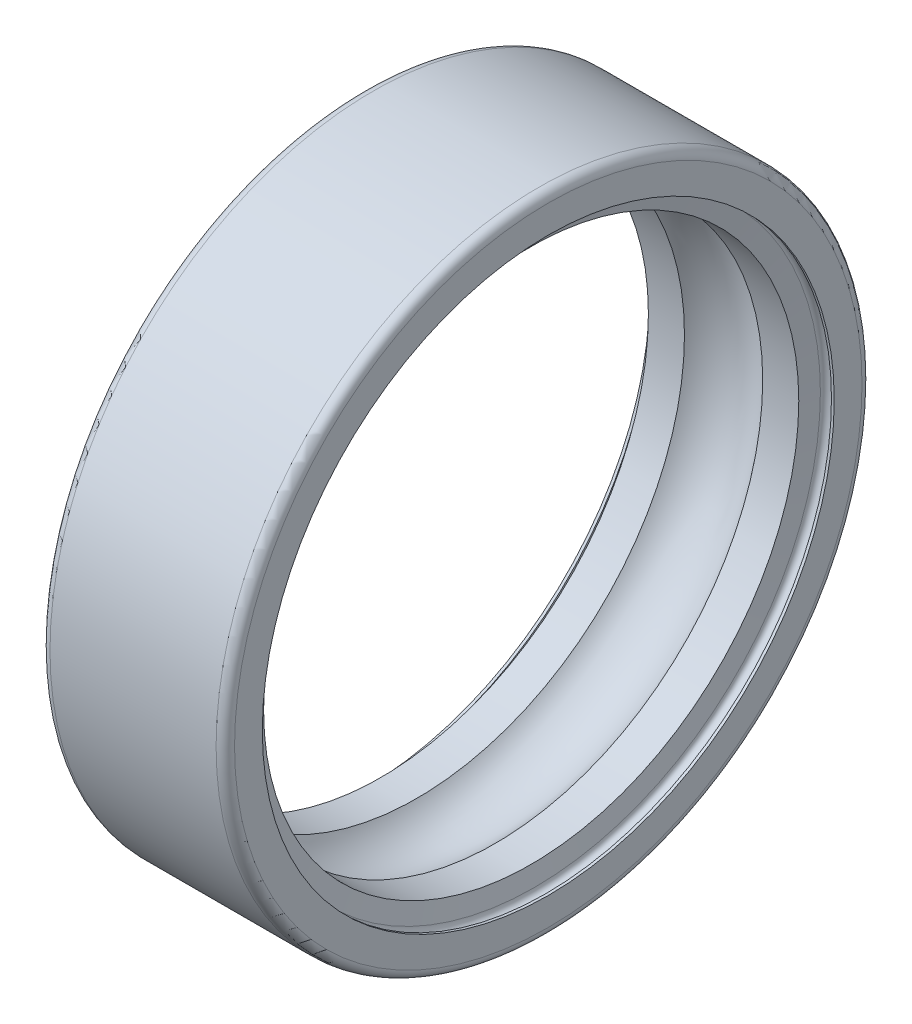
ISO-10303-21;
HEADER;
FILE_DESCRIPTION(('STEP AP214'),'2;1');
FILE_NAME('part.step','',(''),(''),'','','');
FILE_SCHEMA(('AUTOMOTIVE_DESIGN { 1 0 10303 214 1 1 1 1 }'));
ENDSEC;
DATA;
#1=APPLICATION_CONTEXT('core data for automotive mechanical design processes');
#2=APPLICATION_PROTOCOL_DEFINITION('international standard','automotive_design',2000,#1);
#3=PRODUCT_CONTEXT('',#1,'mechanical');
#4=PRODUCT('Part','Part','',(#3));
#5=PRODUCT_RELATED_PRODUCT_CATEGORY('part','',(#4));
#6=PRODUCT_DEFINITION_FORMATION('','',#4);
#7=PRODUCT_DEFINITION_CONTEXT('part definition',#1,'design');
#8=PRODUCT_DEFINITION('design','',#6,#7);
#9=PRODUCT_DEFINITION_SHAPE('','',#8);
#10=(LENGTH_UNIT() NAMED_UNIT(*) SI_UNIT(.MILLI.,.METRE.));
#11=(NAMED_UNIT(*) PLANE_ANGLE_UNIT() SI_UNIT($,.RADIAN.));
#12=(NAMED_UNIT(*) SI_UNIT($,.STERADIAN.) SOLID_ANGLE_UNIT());
#13=UNCERTAINTY_MEASURE_WITH_UNIT(LENGTH_MEASURE(1.E-05),#10,'distance_accuracy_value','');
#14=(GEOMETRIC_REPRESENTATION_CONTEXT(3) GLOBAL_UNCERTAINTY_ASSIGNED_CONTEXT((#13)) GLOBAL_UNIT_ASSIGNED_CONTEXT((#10,
#11,#12)) REPRESENTATION_CONTEXT('',''));
#15=CARTESIAN_POINT('',(0.,0.,0.));
#16=DIRECTION('',(0.,0.,1.));
#17=DIRECTION('',(1.,0.,0.));
#18=AXIS2_PLACEMENT_3D('',#15,#16,#17);
#19=CARTESIAN_POINT('',(50.,0.,0.));
#20=DIRECTION('',(1.,0.,0.));
#21=DIRECTION('',(0.,0.,-1.));
#22=AXIS2_PLACEMENT_3D('',#19,#20,#21);
#23=CYLINDRICAL_SURFACE('',#22,21.);
#24=CARTESIAN_POINT('',(11.4,0.,0.));
#25=DIRECTION('',(1.,0.,0.));
#26=DIRECTION('',(0.,0.,-1.));
#27=AXIS2_PLACEMENT_3D('',#24,#25,#26);
#28=CIRCLE('',#27,21.);
#29=CARTESIAN_POINT('',(11.4,0.,-21.));
#30=VERTEX_POINT('',#29);
#31=EDGE_CURVE('E11',#30,#30,#28,.T.);
#32=ORIENTED_EDGE('',*,*,#31,.F.);
#33=EDGE_LOOP('',(#32));
#34=FACE_BOUND('',#33,.T.);
#35=CARTESIAN_POINT('',(0.6,0.,0.));
#36=DIRECTION('',(1.,0.,0.));
#37=DIRECTION('',(0.,0.,-1.));
#38=AXIS2_PLACEMENT_3D('',#35,#36,#37);
#39=CIRCLE('',#38,21.);
#40=CARTESIAN_POINT('',(0.6,0.,-21.));
#41=VERTEX_POINT('',#40);
#42=EDGE_CURVE('E128',#41,#41,#39,.T.);
#43=ORIENTED_EDGE('',*,*,#42,.T.);
#44=EDGE_LOOP('',(#43));
#45=FACE_BOUND('',#44,.T.);
#46=ADVANCED_FACE('F17',(#34,#45),#23,.T.);
#47=CARTESIAN_POINT('',(11.4,0.,0.));
#48=DIRECTION('',(1.,0.,0.));
#49=DIRECTION('',(0.,0.,-1.));
#50=AXIS2_PLACEMENT_3D('',#47,#48,#49);
#51=TOROIDAL_SURFACE('',#50,20.4,0.600000000000007);
#52=CARTESIAN_POINT('',(12.,0.,0.));
#53=DIRECTION('',(1.,0.,0.));
#54=DIRECTION('',(0.,0.,-1.));
#55=AXIS2_PLACEMENT_3D('',#52,#53,#54);
#56=CIRCLE('',#55,20.4);
#57=CARTESIAN_POINT('',(12.,0.,-20.4));
#58=VERTEX_POINT('',#57);
#59=EDGE_CURVE('E28',#58,#58,#56,.T.);
#60=ORIENTED_EDGE('',*,*,#59,.F.);
#61=EDGE_LOOP('',(#60));
#62=FACE_BOUND('',#61,.T.);
#63=ORIENTED_EDGE('',*,*,#31,.T.);
#64=EDGE_LOOP('',(#63));
#65=FACE_BOUND('',#64,.T.);
#66=ADVANCED_FACE('F159',(#62,#65),#51,.T.);
#67=CARTESIAN_POINT('',(12.,18.595,0.));
#68=DIRECTION('',(1.,0.,0.));
#69=DIRECTION('',(0.,1.,0.));
#70=AXIS2_PLACEMENT_3D('',#67,#68,#69);
#71=PLANE('',#70);
#72=CARTESIAN_POINT('',(12.,0.,0.));
#73=DIRECTION('',(1.,0.,0.));
#74=DIRECTION('',(0.,0.,-1.));
#75=AXIS2_PLACEMENT_3D('',#72,#73,#74);
#76=CIRCLE('',#75,18.595);
#77=CARTESIAN_POINT('',(12.,0.,-18.595));
#78=VERTEX_POINT('',#77);
#79=EDGE_CURVE('E115',#78,#78,#76,.T.);
#80=ORIENTED_EDGE('',*,*,#79,.F.);
#81=EDGE_LOOP('',(#80));
#82=FACE_BOUND('',#81,.T.);
#83=ORIENTED_EDGE('',*,*,#59,.T.);
#84=EDGE_LOOP('',(#83));
#85=FACE_BOUND('',#84,.T.);
#86=ADVANCED_FACE('F19',(#82,#85),#71,.T.);
#87=CARTESIAN_POINT('',(50.,0.,0.));
#88=DIRECTION('',(1.,0.,0.));
#89=DIRECTION('',(0.,0.,-1.));
#90=AXIS2_PLACEMENT_3D('',#87,#88,#89);
#91=CYLINDRICAL_SURFACE('',#90,18.595);
#92=CARTESIAN_POINT('',(11.82,0.,0.));
#93=DIRECTION('',(1.,0.,0.));
#94=DIRECTION('',(0.,0.,-1.));
#95=AXIS2_PLACEMENT_3D('',#92,#93,#94);
#96=CIRCLE('',#95,18.595);
#97=CARTESIAN_POINT('',(11.82,0.,-18.595));
#98=VERTEX_POINT('',#97);
#99=EDGE_CURVE('E110',#98,#98,#96,.T.);
#100=ORIENTED_EDGE('',*,*,#99,.F.);
#101=EDGE_LOOP('',(#100));
#102=FACE_BOUND('',#101,.T.);
#103=ORIENTED_EDGE('',*,*,#79,.T.);
#104=EDGE_LOOP('',(#103));
#105=FACE_BOUND('',#104,.T.);
#106=ADVANCED_FACE('F175',(#102,#105),#91,.F.);
#107=CARTESIAN_POINT('',(11.46,0.,0.));
#108=DIRECTION('',(1.,0.,0.));
#109=DIRECTION('',(0.,0.,-1.));
#110=AXIS2_PLACEMENT_3D('',#107,#108,#109);
#111=TOROIDAL_SURFACE('',#110,18.5950000189953,0.36);
#112=ORIENTED_EDGE('',*,*,#99,.T.);
#113=EDGE_LOOP('',(#112));
#114=FACE_BOUND('',#113,.T.);
#115=CARTESIAN_POINT('',(11.1,0.,0.));
#116=DIRECTION('',(1.,0.,0.));
#117=DIRECTION('',(0.,0.,-1.));
#118=AXIS2_PLACEMENT_3D('',#115,#116,#117);
#119=CIRCLE('',#118,18.595);
#120=CARTESIAN_POINT('',(11.1,0.,-18.595));
#121=VERTEX_POINT('',#120);
#122=EDGE_CURVE('E109',#121,#121,#119,.T.);
#123=ORIENTED_EDGE('',*,*,#122,.F.);
#124=EDGE_LOOP('',(#123));
#125=FACE_BOUND('',#124,.T.);
#126=ADVANCED_FACE('F171',(#114,#125),#111,.F.);
#127=CARTESIAN_POINT('',(10.8892892580534,0.,0.));
#128=DIRECTION('',(1.,0.,0.));
#129=DIRECTION('',(0.,0.,-1.));
#130=AXIS2_PLACEMENT_3D('',#127,#128,#129);
#131=CONICAL_SURFACE('',#130,17.4,1.39626340159546);
#132=CARTESIAN_POINT('',(10.8892892580534,0.,0.));
#133=DIRECTION('',(1.,0.,0.));
#134=DIRECTION('',(0.,0.,-1.));
#135=AXIS2_PLACEMENT_3D('',#132,#133,#134);
#136=CIRCLE('',#135,17.4);
#137=CARTESIAN_POINT('',(10.8892892580534,0.,-17.4));
#138=VERTEX_POINT('',#137);
#139=EDGE_CURVE('E102',#138,#138,#136,.T.);
#140=ORIENTED_EDGE('',*,*,#139,.F.);
#141=EDGE_LOOP('',(#140));
#142=FACE_BOUND('',#141,.T.);
#143=ORIENTED_EDGE('',*,*,#122,.T.);
#144=EDGE_LOOP('',(#143));
#145=FACE_BOUND('',#144,.T.);
#146=ADVANCED_FACE('F174',(#142,#145),#131,.F.);
#147=CARTESIAN_POINT('',(50.,0.,0.));
#148=DIRECTION('',(1.,0.,0.));
#149=DIRECTION('',(0.,0.,-1.));
#150=AXIS2_PLACEMENT_3D('',#147,#148,#149);
#151=CYLINDRICAL_SURFACE('',#150,17.4);
#152=CARTESIAN_POINT('',(8.54374232185574,0.,0.));
#153=DIRECTION('',(1.,0.,0.));
#154=DIRECTION('',(0.,0.,-1.));
#155=AXIS2_PLACEMENT_3D('',#152,#153,#154);
#156=CIRCLE('',#155,17.4);
#157=CARTESIAN_POINT('',(8.54374232185574,0.,-17.4));
#158=VERTEX_POINT('',#157);
#159=EDGE_CURVE('E86',#158,#158,#156,.T.);
#160=ORIENTED_EDGE('',*,*,#159,.F.);
#161=EDGE_LOOP('',(#160));
#162=FACE_BOUND('',#161,.T.);
#163=ORIENTED_EDGE('',*,*,#139,.T.);
#164=EDGE_LOOP('',(#163));
#165=FACE_BOUND('',#164,.T.);
#166=ADVANCED_FACE('F177',(#162,#165),#151,.F.);
#167=CARTESIAN_POINT('',(6.,0.,0.));
#168=DIRECTION('',(1.,0.,0.));
#169=DIRECTION('',(0.,0.,-1.));
#170=AXIS2_PLACEMENT_3D('',#167,#168,#169);
#171=TOROIDAL_SURFACE('',#170,15.5,3.175);
#172=ORIENTED_EDGE('',*,*,#159,.T.);
#173=EDGE_LOOP('',(#172));
#174=FACE_BOUND('',#173,.T.);
#175=CARTESIAN_POINT('',(3.45625767814427,0.,0.));
#176=DIRECTION('',(1.,0.,0.));
#177=DIRECTION('',(0.,0.,-1.));
#178=AXIS2_PLACEMENT_3D('',#175,#176,#177);
#179=CIRCLE('',#178,17.4);
#180=CARTESIAN_POINT('',(3.45625767814427,0.,-17.4));
#181=VERTEX_POINT('',#180);
#182=EDGE_CURVE('E92',#181,#181,#179,.T.);
#183=ORIENTED_EDGE('',*,*,#182,.F.);
#184=EDGE_LOOP('',(#183));
#185=FACE_BOUND('',#184,.T.);
#186=ADVANCED_FACE('F180',(#174,#185),#171,.F.);
#187=CARTESIAN_POINT('',(50.,0.,0.));
#188=DIRECTION('',(1.,0.,0.));
#189=DIRECTION('',(0.,0.,-1.));
#190=AXIS2_PLACEMENT_3D('',#187,#188,#189);
#191=CYLINDRICAL_SURFACE('',#190,17.4);
#192=CARTESIAN_POINT('',(1.11071074194662,0.,0.));
#193=DIRECTION('',(1.,0.,0.));
#194=DIRECTION('',(0.,0.,-1.));
#195=AXIS2_PLACEMENT_3D('',#192,#193,#194);
#196=CIRCLE('',#195,17.4);
#197=CARTESIAN_POINT('',(1.11071074194662,0.,-17.4));
#198=VERTEX_POINT('',#197);
#199=EDGE_CURVE('E96',#198,#198,#196,.T.);
#200=ORIENTED_EDGE('',*,*,#199,.F.);
#201=EDGE_LOOP('',(#200));
#202=FACE_BOUND('',#201,.T.);
#203=ORIENTED_EDGE('',*,*,#182,.T.);
#204=EDGE_LOOP('',(#203));
#205=FACE_BOUND('',#204,.T.);
#206=ADVANCED_FACE('F93',(#202,#205),#191,.F.);
#207=CARTESIAN_POINT('',(0.9,0.,0.));
#208=DIRECTION('',(-1.,0.,0.));
#209=DIRECTION('',(0.,0.,1.));
#210=AXIS2_PLACEMENT_3D('',#207,#208,#209);
#211=CONICAL_SURFACE('',#210,18.595,1.39626340159547);
#212=CARTESIAN_POINT('',(0.9,0.,0.));
#213=DIRECTION('',(1.,0.,0.));
#214=DIRECTION('',(0.,0.,-1.));
#215=AXIS2_PLACEMENT_3D('',#212,#213,#214);
#216=CIRCLE('',#215,18.595);
#217=CARTESIAN_POINT('',(0.9,0.,-18.595));
#218=VERTEX_POINT('',#217);
#219=EDGE_CURVE('E104',#218,#218,#216,.T.);
#220=ORIENTED_EDGE('',*,*,#219,.F.);
#221=EDGE_LOOP('',(#220));
#222=FACE_BOUND('',#221,.T.);
#223=ORIENTED_EDGE('',*,*,#199,.T.);
#224=EDGE_LOOP('',(#223));
#225=FACE_BOUND('',#224,.T.);
#226=ADVANCED_FACE('F145',(#222,#225),#211,.F.);
#227=CARTESIAN_POINT('',(0.54,0.,0.));
#228=DIRECTION('',(1.,0.,0.));
#229=DIRECTION('',(0.,0.,-1.));
#230=AXIS2_PLACEMENT_3D('',#227,#228,#229);
#231=TOROIDAL_SURFACE('',#230,18.595,0.36);
#232=ORIENTED_EDGE('',*,*,#219,.T.);
#233=EDGE_LOOP('',(#232));
#234=FACE_BOUND('',#233,.T.);
#235=CARTESIAN_POINT('',(0.18,0.,0.));
#236=DIRECTION('',(1.,0.,0.));
#237=DIRECTION('',(0.,0.,-1.));
#238=AXIS2_PLACEMENT_3D('',#235,#236,#237);
#239=CIRCLE('',#238,18.595);
#240=CARTESIAN_POINT('',(0.18,0.,-18.595));
#241=VERTEX_POINT('',#240);
#242=EDGE_CURVE('E124',#241,#241,#239,.T.);
#243=ORIENTED_EDGE('',*,*,#242,.F.);
#244=EDGE_LOOP('',(#243));
#245=FACE_BOUND('',#244,.T.);
#246=ADVANCED_FACE('F143',(#234,#245),#231,.F.);
#247=CARTESIAN_POINT('',(50.,0.,0.));
#248=DIRECTION('',(1.,0.,0.));
#249=DIRECTION('',(0.,0.,-1.));
#250=AXIS2_PLACEMENT_3D('',#247,#248,#249);
#251=CYLINDRICAL_SURFACE('',#250,18.595);
#252=CARTESIAN_POINT('',(0.,0.,0.));
#253=DIRECTION('',(1.,0.,0.));
#254=DIRECTION('',(0.,0.,-1.));
#255=AXIS2_PLACEMENT_3D('',#252,#253,#254);
#256=CIRCLE('',#255,18.595);
#257=CARTESIAN_POINT('',(0.,0.,-18.595));
#258=VERTEX_POINT('',#257);
#259=EDGE_CURVE('E126',#258,#258,#256,.T.);
#260=ORIENTED_EDGE('',*,*,#259,.F.);
#261=EDGE_LOOP('',(#260));
#262=FACE_BOUND('',#261,.T.);
#263=ORIENTED_EDGE('',*,*,#242,.T.);
#264=EDGE_LOOP('',(#263));
#265=FACE_BOUND('',#264,.T.);
#266=ADVANCED_FACE('F141',(#262,#265),#251,.F.);
#267=CARTESIAN_POINT('',(0.,20.4,0.));
#268=DIRECTION('',(-1.,0.,0.));
#269=DIRECTION('',(0.,0.,1.));
#270=AXIS2_PLACEMENT_3D('',#267,#268,#269);
#271=PLANE('',#270);
#272=CARTESIAN_POINT('',(0.,0.,0.));
#273=DIRECTION('',(1.,0.,0.));
#274=DIRECTION('',(0.,0.,-1.));
#275=AXIS2_PLACEMENT_3D('',#272,#273,#274);
#276=CIRCLE('',#275,20.4);
#277=CARTESIAN_POINT('',(0.,0.,-20.4));
#278=VERTEX_POINT('',#277);
#279=EDGE_CURVE('E21',#278,#278,#276,.T.);
#280=ORIENTED_EDGE('',*,*,#279,.F.);
#281=EDGE_LOOP('',(#280));
#282=FACE_BOUND('',#281,.T.);
#283=ORIENTED_EDGE('',*,*,#259,.T.);
#284=EDGE_LOOP('',(#283));
#285=FACE_BOUND('',#284,.T.);
#286=ADVANCED_FACE('F152',(#282,#285),#271,.T.);
#287=CARTESIAN_POINT('',(0.6,0.,0.));
#288=DIRECTION('',(1.,0.,0.));
#289=DIRECTION('',(0.,0.,-1.));
#290=AXIS2_PLACEMENT_3D('',#287,#288,#289);
#291=TOROIDAL_SURFACE('',#290,20.4,0.600000000000007);
#292=ORIENTED_EDGE('',*,*,#42,.F.);
#293=EDGE_LOOP('',(#292));
#294=FACE_BOUND('',#293,.T.);
#295=ORIENTED_EDGE('',*,*,#279,.T.);
#296=EDGE_LOOP('',(#295));
#297=FACE_BOUND('',#296,.T.);
#298=ADVANCED_FACE('F264',(#294,#297),#291,.T.);
#299=CLOSED_SHELL('',(#46,#66,#86,#106,#126,#146,#166,#186,#206,#226,#246,#266,#286,#298));
#300=MANIFOLD_SOLID_BREP('B1',#299);
#301=ADVANCED_BREP_SHAPE_REPRESENTATION('',(#18,#300),#14);
#302=SHAPE_DEFINITION_REPRESENTATION(#9,#301);
ENDSEC;
END-ISO-10303-21;
